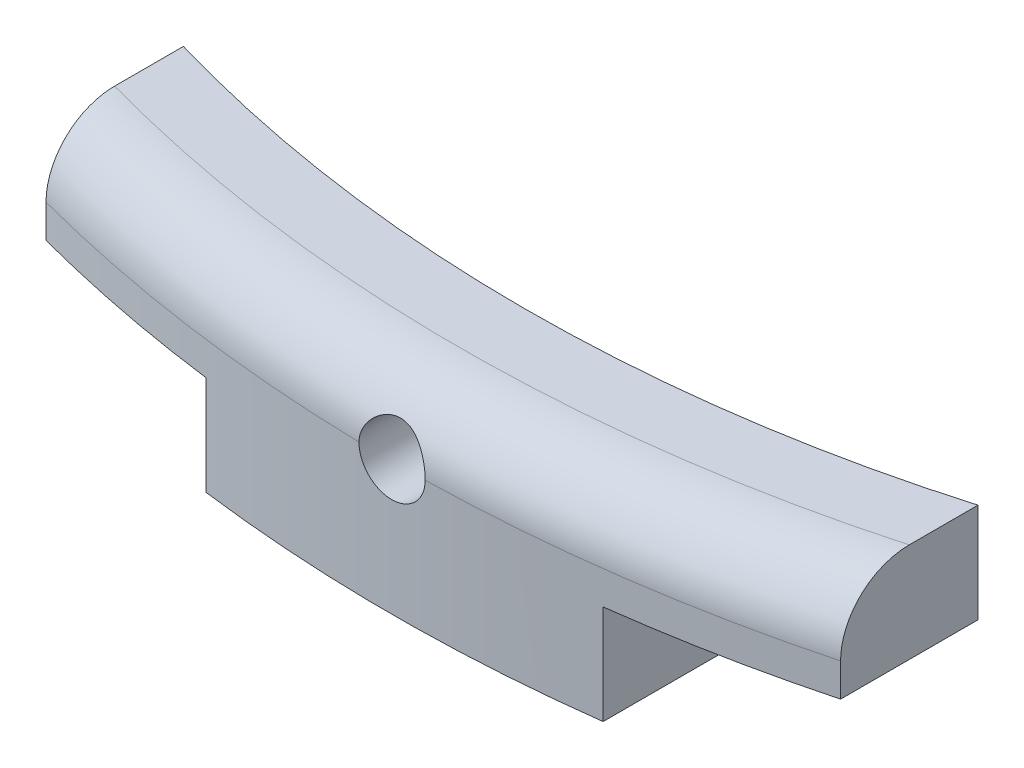
ISO-10303-21;
HEADER;
FILE_DESCRIPTION(('STEP AP214'),'2;1');
FILE_NAME('part.step','',(''),(''),'','','');
FILE_SCHEMA(('AUTOMOTIVE_DESIGN { 1 0 10303 214 1 1 1 1 }'));
ENDSEC;
DATA;
#1=APPLICATION_CONTEXT('core data for automotive mechanical design processes');
#2=APPLICATION_PROTOCOL_DEFINITION('international standard','automotive_design',2000,#1);
#3=PRODUCT_CONTEXT('',#1,'mechanical');
#4=PRODUCT('Part','Part','',(#3));
#5=PRODUCT_RELATED_PRODUCT_CATEGORY('part','',(#4));
#6=PRODUCT_DEFINITION_FORMATION('','',#4);
#7=PRODUCT_DEFINITION_CONTEXT('part definition',#1,'design');
#8=PRODUCT_DEFINITION('design','',#6,#7);
#9=PRODUCT_DEFINITION_SHAPE('','',#8);
#10=(LENGTH_UNIT() NAMED_UNIT(*) SI_UNIT(.MILLI.,.METRE.));
#11=(NAMED_UNIT(*) PLANE_ANGLE_UNIT() SI_UNIT($,.RADIAN.));
#12=(NAMED_UNIT(*) SI_UNIT($,.STERADIAN.) SOLID_ANGLE_UNIT());
#13=UNCERTAINTY_MEASURE_WITH_UNIT(LENGTH_MEASURE(1.E-05),#10,'distance_accuracy_value','');
#14=(GEOMETRIC_REPRESENTATION_CONTEXT(3) GLOBAL_UNCERTAINTY_ASSIGNED_CONTEXT((#13)) GLOBAL_UNIT_ASSIGNED_CONTEXT((#10,
#11,#12)) REPRESENTATION_CONTEXT('',''));
#15=CARTESIAN_POINT('',(0.,0.,0.));
#16=DIRECTION('',(0.,0.,1.));
#17=DIRECTION('',(1.,0.,0.));
#18=AXIS2_PLACEMENT_3D('',#15,#16,#17);
#19=CARTESIAN_POINT('',(0.,3.,0.));
#20=DIRECTION('',(0.,-1.,0.));
#21=DIRECTION('',(0.,0.,-1.));
#22=AXIS2_PLACEMENT_3D('',#19,#20,#21);
#23=CYLINDRICAL_SURFACE('',#22,21.5);
#24=CARTESIAN_POINT('',(0.,3.,0.));
#25=DIRECTION('',(0.,-1.,0.));
#26=DIRECTION('',(0.,0.,1.));
#27=AXIS2_PLACEMENT_3D('',#24,#25,#26);
#28=CIRCLE('',#27,21.5);
#29=CARTESIAN_POINT('',(6.,3.,20.6458228220626));
#30=VERTEX_POINT('',#29);
#31=CARTESIAN_POINT('',(-6.,3.,20.6458228220626));
#32=VERTEX_POINT('',#31);
#33=EDGE_CURVE('E173',#30,#32,#28,.T.);
#34=ORIENTED_EDGE('',*,*,#33,.F.);
#35=DIRECTION('',(0.,1.,0.));
#36=VECTOR('',#35,1.);
#37=CARTESIAN_POINT('',(6.,1.5,20.6458228220626));
#38=LINE('',#37,#36);
#39=CARTESIAN_POINT('',(6.,1.5,20.6458228220626));
#40=VERTEX_POINT('',#39);
#41=EDGE_CURVE('E326',#40,#30,#38,.T.);
#42=ORIENTED_EDGE('',*,*,#41,.F.);
#43=CARTESIAN_POINT('',(0.,1.5,0.));
#44=DIRECTION('',(0.,-1.,0.));
#45=DIRECTION('',(0.,0.,1.));
#46=AXIS2_PLACEMENT_3D('',#43,#44,#45);
#47=CIRCLE('',#46,21.5);
#48=CARTESIAN_POINT('',(3.,1.5,21.2896688560438));
#49=VERTEX_POINT('',#48);
#50=EDGE_CURVE('E188',#40,#49,#47,.T.);
#51=ORIENTED_EDGE('',*,*,#50,.T.);
#52=DIRECTION('',(0.,-1.,0.));
#53=VECTOR('',#52,1.);
#54=CARTESIAN_POINT('',(3.,3.,21.2896688560438));
#55=LINE('',#54,#53);
#56=CARTESIAN_POINT('',(3.,0.,21.2896688560438));
#57=VERTEX_POINT('',#56);
#58=EDGE_CURVE('E303',#49,#57,#55,.T.);
#59=ORIENTED_EDGE('',*,*,#58,.T.);
#60=CARTESIAN_POINT('',(0.,0.,0.));
#61=DIRECTION('',(0.,-1.,0.));
#62=DIRECTION('',(0.,0.,1.));
#63=AXIS2_PLACEMENT_3D('',#60,#61,#62);
#64=CIRCLE('',#63,21.5);
#65=CARTESIAN_POINT('',(-3.,0.,21.2896688560438));
#66=VERTEX_POINT('',#65);
#67=EDGE_CURVE('E323',#57,#66,#64,.T.);
#68=ORIENTED_EDGE('',*,*,#67,.T.);
#69=DIRECTION('',(0.,-1.,0.));
#70=VECTOR('',#69,1.);
#71=CARTESIAN_POINT('',(-3.,3.,21.2896688560438));
#72=LINE('',#71,#70);
#73=CARTESIAN_POINT('',(-3.,1.5,21.2896688560438));
#74=VERTEX_POINT('',#73);
#75=EDGE_CURVE('E304',#74,#66,#72,.T.);
#76=ORIENTED_EDGE('',*,*,#75,.F.);
#77=CARTESIAN_POINT('',(-6.,1.5,20.6458228220626));
#78=VERTEX_POINT('',#77);
#79=EDGE_CURVE('E338',#74,#78,#47,.T.);
#80=ORIENTED_EDGE('',*,*,#79,.T.);
#81=DIRECTION('',(0.,1.,0.));
#82=VECTOR('',#81,1.);
#83=CARTESIAN_POINT('',(-6.,1.5,20.6458228220626));
#84=LINE('',#83,#82);
#85=EDGE_CURVE('E337',#78,#32,#84,.T.);
#86=ORIENTED_EDGE('',*,*,#85,.T.);
#87=EDGE_LOOP('',(#34,#42,#51,#59,#68,#76,#80,#86));
#88=FACE_BOUND('',#87,.T.);
#89=CARTESIAN_POINT('',(-0.5,2.,21.4941852602047));
#90=CARTESIAN_POINT('',(-0.499998755966297,1.97191885513614,21.494185338737));
#91=CARTESIAN_POINT('',(-0.497626408429424,1.94381744544174,21.4942408813021));
#92=CARTESIAN_POINT('',(-0.488195720650948,1.88838883302728,21.4944571070674));
#93=CARTESIAN_POINT('',(-0.481131765847627,1.86106259888415,21.4946179162393));
#94=CARTESIAN_POINT('',(-0.462519317690186,1.80799536228125,21.4950264488051));
#95=CARTESIAN_POINT('',(-0.450972997511034,1.78225359862238,21.4952741300752));
#96=CARTESIAN_POINT('',(-0.423726640826891,1.73308100889049,21.4958284440998));
#97=CARTESIAN_POINT('',(-0.408027625826196,1.70964961644194,21.4961350623515));
#98=CARTESIAN_POINT('',(-0.372915204298479,1.66574787306663,21.4967728213401));
#99=CARTESIAN_POINT('',(-0.353500782725025,1.64527833400603,21.4971039687632));
#100=CARTESIAN_POINT('',(-0.311510232957952,1.60788811758936,21.497753402203));
#101=CARTESIAN_POINT('',(-0.288933979613323,1.59096758077545,21.49807168771));
#102=CARTESIAN_POINT('',(-0.241258506293179,1.56115511212507,21.4986595360439));
#103=CARTESIAN_POINT('',(-0.216159047728313,1.54826356173614,21.4989290942564));
#104=CARTESIAN_POINT('',(-0.164151368754836,1.52687753707167,21.4993890587513));
#105=CARTESIAN_POINT('',(-0.137243154154621,1.51838304867676,21.4995794652878));
#106=CARTESIAN_POINT('',(-0.0823869444321757,1.50603373097711,21.4998596312861));
#107=CARTESIAN_POINT('',(-0.054439138852766,1.50217806013576,21.4999494090029));
#108=CARTESIAN_POINT('',(0.00170718008010479,1.49921323745673,21.5000182577353));
#109=CARTESIAN_POINT('',(0.0299056926519211,1.50010407082577,21.499997329096));
#110=CARTESIAN_POINT('',(0.0857472649433052,1.50660624664039,21.4998471403128));
#111=CARTESIAN_POINT('',(0.113390430898381,1.5122166772709,21.4997179010943));
#112=CARTESIAN_POINT('',(0.167342437398209,1.52799737958449,21.4993656828235));
#113=CARTESIAN_POINT('',(0.1936512756169,1.53816765921621,21.4991427036079));
#114=CARTESIAN_POINT('',(0.244190727243678,1.56278040650035,21.4986281035013));
#115=CARTESIAN_POINT('',(0.268421136934731,1.57722329231617,21.4983364758922));
#116=CARTESIAN_POINT('',(0.314113672988315,1.60997095276577,21.4977174499698));
#117=CARTESIAN_POINT('',(0.335575795995432,1.62827573208044,21.497390051613));
#118=CARTESIAN_POINT('',(0.375127846092383,1.66823273764598,21.4967362952916));
#119=CARTESIAN_POINT('',(0.393216973152506,1.68988575583237,21.4964099375917));
#120=CARTESIAN_POINT('',(0.425503384037781,1.73592178799792,21.4957951346947));
#121=CARTESIAN_POINT('',(0.439700667282546,1.76030480238421,21.4955066895032));
#122=CARTESIAN_POINT('',(0.463800284579462,1.81110911526541,21.4950002397015));
#123=CARTESIAN_POINT('',(0.473702593703395,1.83753042558963,21.4947822355));
#124=CARTESIAN_POINT('',(0.488930658807138,1.89166111597341,21.494441265539));
#125=CARTESIAN_POINT('',(0.494256422361824,1.91937049390094,21.4943182996221));
#126=CARTESIAN_POINT('',(0.500179236306937,1.97528378567812,21.4941812987667));
#127=CARTESIAN_POINT('',(0.50077739434082,2.00348758213703,21.4941672383124));
#128=CARTESIAN_POINT('',(0.497230903053952,2.05959520736367,21.4942495671429));
#129=CARTESIAN_POINT('',(0.493086256948856,2.08749903633476,21.4943459563528));
#130=CARTESIAN_POINT('',(0.480172726942071,2.14221154305694,21.4946382948524));
#131=CARTESIAN_POINT('',(0.471404345511334,2.16902033946647,21.4948342333239));
#132=CARTESIAN_POINT('',(0.449492760378763,2.2207854074938,21.4953035720075));
#133=CARTESIAN_POINT('',(0.436349551608551,2.24574167696534,21.4955769723094));
#134=CARTESIAN_POINT('',(0.406058547012527,2.29309836924976,21.4961704752538));
#135=CARTESIAN_POINT('',(0.38891000494981,2.31549831463273,21.496490586595));
#136=CARTESIAN_POINT('',(0.351096216975069,2.35710170879313,21.4971413929455));
#137=CARTESIAN_POINT('',(0.330430965104612,2.37630515215456,21.4974720879727));
#138=CARTESIAN_POINT('',(0.286165633179736,2.41097410897975,21.4981068549215));
#139=CARTESIAN_POINT('',(0.262564993463237,2.42643890797262,21.4984109217471));
#140=CARTESIAN_POINT('',(0.213101700796868,2.4531866919116,21.4989580814401));
#141=CARTESIAN_POINT('',(0.18723905186496,2.46446968428556,21.4992011744157));
#142=CARTESIAN_POINT('',(0.133988589367627,2.48253232337691,21.4995989577116));
#143=CARTESIAN_POINT('',(0.106600933440216,2.48931243461816,21.4997536571505));
#144=CARTESIAN_POINT('',(0.0510756409768839,2.49817837439227,21.499957249993));
#145=CARTESIAN_POINT('',(0.0229380042960178,2.50026420201787,21.5000061433762));
#146=CARTESIAN_POINT('',(-0.0332813313138092,2.49968230436628,21.4999926126193));
#147=CARTESIAN_POINT('',(-0.0613630419438295,2.49701570827316,21.4999302149222));
#148=CARTESIAN_POINT('',(-0.116680106658745,2.48700697298764,21.499701186257));
#149=CARTESIAN_POINT('',(-0.143915459055956,2.47966482447257,21.4995345550811));
#150=CARTESIAN_POINT('',(-0.196767300396706,2.46051348702593,21.4991158337094));
#151=CARTESIAN_POINT('',(-0.222383760585855,2.44870421877643,21.4988637419961));
#152=CARTESIAN_POINT('',(-0.271269750679197,2.42095445611713,21.4983025159235));
#153=CARTESIAN_POINT('',(-0.294539368313775,2.4050141162159,21.4979933836977));
#154=CARTESIAN_POINT('',(-0.338075842972769,2.36945214804196,21.4973528527812));
#155=CARTESIAN_POINT('',(-0.358342305663433,2.34983003709403,21.4970214511746));
#156=CARTESIAN_POINT('',(-0.395298732697557,2.30745619072678,21.4963736832631));
#157=CARTESIAN_POINT('',(-0.411987808875125,2.28470368041281,21.496057320707));
#158=CARTESIAN_POINT('',(-0.441317463383388,2.23670797367039,21.4954752190066));
#159=CARTESIAN_POINT('',(-0.453955688419948,2.21146334056983,21.4952095093246));
#160=CARTESIAN_POINT('',(-0.474799808058266,2.1592295659464,21.4947592419056));
#161=CARTESIAN_POINT('',(-0.483010999327688,2.13224255257445,21.4945745872407));
#162=CARTESIAN_POINT('',(-0.492586962874531,2.08757038117134,21.4943567169088));
#163=CARTESIAN_POINT('',(-0.495363365332656,2.07017530815001,21.4942926990413));
#164=CARTESIAN_POINT('',(-0.499070273557217,2.03518947649953,21.4942069460845));
#165=CARTESIAN_POINT('',(-0.500000779647636,2.01759871790474,21.4941852109877));
#166=CARTESIAN_POINT('',(-0.5,2.,21.4941852602047));
#167=B_SPLINE_CURVE_WITH_KNOTS('',3,(#89,#90,#91,#92,#93,#94,#95,#96,#97,#98,#99,#100,#101,#102,
#103,#104,#105,#106,#107,#108,#109,#110,#111,#112,#113,#114,#115,#116,#117,#118,#119,#120,#121,
#122,#123,#124,#125,#126,#127,#128,#129,#130,#131,#132,#133,#134,#135,#136,#137,#138,#139,#140,
#141,#142,#143,#144,#145,#146,#147,#148,#149,#150,#151,#152,#153,#154,#155,#156,#157,#158,#159,
#160,#161,#162,#163,#164,#165,#166),.UNSPECIFIED.,.T.,.F.,(4,2,2,2,2,2,2,2,2,2,2,2,2,2,2,2,2,2,
2,2,2,2,2,2,2,2,2,2,2,2,2,2,2,2,2,2,2,2,4),(0.,0.0841791979092221,0.168459317089465,
0.252698625860825,0.336917232190344,0.421158879914501,0.505403863018055,0.589656819668832,
0.673909505773871,0.758146905134822,0.842384041955608,0.926604908096697,1.01082592105048,
1.09505517951109,1.17928454006421,1.26353385335776,1.34778317921534,1.43203299405316,
1.51628266944452,1.60051260516676,1.68474248378055,1.76896321084374,1.85318403547968,
1.93742056390023,2.0216572350459,2.10590999147555,2.19016259825175,2.27440651205381,
2.3586504421375,2.44287435838663,2.52709844257208,2.61132402230617,2.69554645232599,
2.77977993151713,2.86403429938594,2.94833752549202,3.03253966298692,3.0852955682269,
3.1380514642074),.UNSPECIFIED.);
#168=CARTESIAN_POINT('',(-0.5,2.,21.4941852602047));
#169=VERTEX_POINT('',#168);
#170=EDGE_CURVE('E118',#169,#169,#167,.T.);
#171=ORIENTED_EDGE('',*,*,#170,.T.);
#172=EDGE_LOOP('',(#171));
#173=FACE_BOUND('',#172,.T.);
#174=ADVANCED_FACE('F33',(#88,#173),#23,.F.);
#175=CARTESIAN_POINT('',(0.,3.,0.));
#176=DIRECTION('',(0.,-1.,0.));
#177=DIRECTION('',(0.,0.,-1.));
#178=AXIS2_PLACEMENT_3D('',#175,#176,#177);
#179=CYLINDRICAL_SURFACE('',#178,23.5);
#180=CARTESIAN_POINT('',(0.5,2.,23.4946802489415));
#181=CARTESIAN_POINT('',(0.5000239012505,1.97187495020581,23.4946783023282));
#182=CARTESIAN_POINT('',(0.497628374945154,1.94375710538118,23.4947306971344));
#183=CARTESIAN_POINT('',(0.48817468976348,1.88833718398176,23.4949297868081));
#184=CARTESIAN_POINT('',(0.481119986575986,1.86103451846738,23.4950764117834));
#185=CARTESIAN_POINT('',(0.46251941203673,1.80799012424866,23.4954497044488));
#186=CARTESIAN_POINT('',(0.450971475141283,1.7822491197412,23.495676408947));
#187=CARTESIAN_POINT('',(0.42372274852547,1.73307571555411,23.4961836311518));
#188=CARTESIAN_POINT('',(0.408022760430556,1.70964287144137,23.4964641384678));
#189=CARTESIAN_POINT('',(0.372909456137809,1.66574134811288,23.497047593182));
#190=CARTESIAN_POINT('',(0.353495534988105,1.64527315275595,23.4973505442309));
#191=CARTESIAN_POINT('',(0.311504087698404,1.60788315420172,23.4979447043537));
#192=CARTESIAN_POINT('',(0.288926080272495,1.5909618915038,23.4982359116325));
#193=CARTESIAN_POINT('',(0.241247962797727,1.5611492690502,23.4987737324286));
#194=CARTESIAN_POINT('',(0.216147724773407,1.54825811391474,23.4990203436814));
#195=CARTESIAN_POINT('',(0.164140266481915,1.52687376375069,23.4994411316055));
#196=CARTESIAN_POINT('',(0.137233163610803,1.51838028330706,23.4996153129774));
#197=CARTESIAN_POINT('',(0.0823781118914567,1.50603225895979,23.4998716085604));
#198=CARTESIAN_POINT('',(0.0544303019691278,1.50217709815071,23.4999537350148));
#199=CARTESIAN_POINT('',(-0.00171661877036668,1.49921323455984,23.500016703993));
#200=CARTESIAN_POINT('',(-0.0299157350736507,1.50010463565203,23.4999975443002));
#201=CARTESIAN_POINT('',(-0.0857590356785831,1.50660822185892,23.4998601081157));
#202=CARTESIAN_POINT('',(-0.113403314526651,1.5122195955581,23.4997418486603));
#203=CARTESIAN_POINT('',(-0.167357266505371,1.52800256757622,23.499419564031));
#204=CARTESIAN_POINT('',(-0.193666943148384,1.53817415389306,23.4992155390828));
#205=CARTESIAN_POINT('',(-0.244208092072518,1.56278999946872,23.4987446874388));
#206=CARTESIAN_POINT('',(-0.26843933880874,1.5772347216805,23.498477853939));
#207=CARTESIAN_POINT('',(-0.314131955834937,1.60998567310042,23.4979114827668));
#208=CARTESIAN_POINT('',(-0.335593458199145,1.62829171807308,23.4976119466551));
#209=CARTESIAN_POINT('',(-0.375140662693392,1.6682475442818,23.4970138844919));
#210=CARTESIAN_POINT('',(-0.393226148354517,1.68989753976817,23.4967153585064));
#211=CARTESIAN_POINT('',(-0.425511315618826,1.73593439680004,23.4961529191999));
#212=CARTESIAN_POINT('',(-0.439709762829113,1.76032212429844,23.4958890168881));
#213=CARTESIAN_POINT('',(-0.4638185462251,1.81114946862726,23.4954254634994));
#214=CARTESIAN_POINT('',(-0.473726252783628,1.83759033207278,23.4952258518428));
#215=CARTESIAN_POINT('',(-0.48894262277272,1.89172785667683,23.4949142696192));
#216=CARTESIAN_POINT('',(-0.494258307725359,1.91942253217635,23.4948021652729));
#217=CARTESIAN_POINT('',(-0.499075521759939,1.96484292492919,23.4946998278548));
#218=CARTESIAN_POINT('',(-0.500007518467565,1.98242607246765,23.4946797057675));
#219=CARTESIAN_POINT('',(-0.5,2.,23.4946802489415));
#220=B_SPLINE_CURVE_WITH_KNOTS('',3,(#180,#181,#182,#183,#184,#185,#186,#187,#188,#189,#190,
#191,#192,#193,#194,#195,#196,#197,#198,#199,#200,#201,#202,#203,#204,#205,#206,#207,#208,#209,
#210,#211,#212,#213,#214,#215,#216,#217,#218,#219),.UNSPECIFIED.,.F.,.F.,(4,2,2,2,2,2,2,2,2,2,2,
2,2,2,2,2,2,2,2,4),(0.,0.0842629323957733,0.168463437466064,0.252702695404556,0.33692570135238,
0.421162437842469,0.505412001431646,0.58966584192007,0.673914213534217,0.758151378713671,
0.842390387350772,0.92661491732905,1.01083922563652,1.09507266217735,1.17930208059277,
1.26353689791293,1.34779843443426,1.4321115387279,1.51629549303206,1.56901707022118),.UNSPECIFIED.);
#221=CARTESIAN_POINT('',(0.5,2.,23.4946802489415));
#222=VERTEX_POINT('',#221);
#223=CARTESIAN_POINT('',(-0.5,2.,23.4946802489415));
#224=VERTEX_POINT('',#223);
#225=EDGE_CURVE('E53',#222,#224,#220,.T.);
#226=ORIENTED_EDGE('',*,*,#225,.T.);
#227=CARTESIAN_POINT('',(0.,2.,0.));
#228=DIRECTION('',(0.,1.,0.));
#229=DIRECTION('',(0.,0.,1.));
#230=AXIS2_PLACEMENT_3D('',#227,#228,#229);
#231=CIRCLE('',#230,23.5);
#232=CARTESIAN_POINT('',(-6.,2.,22.7211355350035));
#233=VERTEX_POINT('',#232);
#234=EDGE_CURVE('E60',#224,#233,#231,.F.);
#235=ORIENTED_EDGE('',*,*,#234,.T.);
#236=DIRECTION('',(0.,1.,0.));
#237=VECTOR('',#236,1.);
#238=CARTESIAN_POINT('',(-6.,1.5,22.7211355350035));
#239=LINE('',#238,#237);
#240=CARTESIAN_POINT('',(-6.,1.5,22.7211355350035));
#241=VERTEX_POINT('',#240);
#242=EDGE_CURVE('E341',#241,#233,#239,.T.);
#243=ORIENTED_EDGE('',*,*,#242,.F.);
#244=CARTESIAN_POINT('',(0.,1.5,0.));
#245=DIRECTION('',(0.,1.,0.));
#246=DIRECTION('',(0.,0.,1.));
#247=AXIS2_PLACEMENT_3D('',#244,#245,#246);
#248=CIRCLE('',#247,23.5);
#249=CARTESIAN_POINT('',(-3.,1.5,23.3077240416133));
#250=VERTEX_POINT('',#249);
#251=EDGE_CURVE('E296',#241,#250,#248,.T.);
#252=ORIENTED_EDGE('',*,*,#251,.T.);
#253=DIRECTION('',(0.,-1.,0.));
#254=VECTOR('',#253,1.);
#255=CARTESIAN_POINT('',(-3.,3.,23.3077240416133));
#256=LINE('',#255,#254);
#257=CARTESIAN_POINT('',(-3.,0.,23.3077240416133));
#258=VERTEX_POINT('',#257);
#259=EDGE_CURVE('E308',#250,#258,#256,.T.);
#260=ORIENTED_EDGE('',*,*,#259,.T.);
#261=CARTESIAN_POINT('',(0.,0.,0.));
#262=DIRECTION('',(0.,1.,0.));
#263=DIRECTION('',(0.,0.,1.));
#264=AXIS2_PLACEMENT_3D('',#261,#262,#263);
#265=CIRCLE('',#264,23.5);
#266=CARTESIAN_POINT('',(3.,0.,23.3077240416133));
#267=VERTEX_POINT('',#266);
#268=EDGE_CURVE('E306',#258,#267,#265,.T.);
#269=ORIENTED_EDGE('',*,*,#268,.T.);
#270=DIRECTION('',(0.,-1.,0.));
#271=VECTOR('',#270,1.);
#272=CARTESIAN_POINT('',(3.,3.,23.3077240416133));
#273=LINE('',#272,#271);
#274=CARTESIAN_POINT('',(3.,1.5,23.3077240416133));
#275=VERTEX_POINT('',#274);
#276=EDGE_CURVE('E301',#275,#267,#273,.T.);
#277=ORIENTED_EDGE('',*,*,#276,.F.);
#278=CARTESIAN_POINT('',(6.,1.5,22.7211355350035));
#279=VERTEX_POINT('',#278);
#280=EDGE_CURVE('E287',#275,#279,#248,.T.);
#281=ORIENTED_EDGE('',*,*,#280,.T.);
#282=DIRECTION('',(0.,1.,0.));
#283=VECTOR('',#282,1.);
#284=CARTESIAN_POINT('',(6.,1.5,22.7211355350035));
#285=LINE('',#284,#283);
#286=CARTESIAN_POINT('',(6.,2.,22.7211355350035));
#287=VERTEX_POINT('',#286);
#288=EDGE_CURVE('E348',#279,#287,#285,.T.);
#289=ORIENTED_EDGE('',*,*,#288,.T.);
#290=EDGE_CURVE('E47',#287,#222,#231,.F.);
#291=ORIENTED_EDGE('',*,*,#290,.T.);
#292=EDGE_LOOP('',(#226,#235,#243,#252,#260,#269,#277,#281,#289,#291));
#293=FACE_BOUND('',#292,.T.);
#294=ADVANCED_FACE('F120',(#293),#179,.T.);
#295=CARTESIAN_POINT('',(0.,2.,0.));
#296=DIRECTION('',(0.,1.,0.));
#297=DIRECTION('',(0.,0.,1.));
#298=AXIS2_PLACEMENT_3D('',#295,#296,#297);
#299=TOROIDAL_SURFACE('',#298,22.5,1.);
#300=ORIENTED_EDGE('',*,*,#234,.F.);
#301=CARTESIAN_POINT('',(0.496157695524152,1.93813287486748,23.4928456717974));
#302=CARTESIAN_POINT('',(0.499394852554745,1.96383193950509,23.4944054519467));
#303=CARTESIAN_POINT('',(0.500577788038148,1.98983167754558,23.4949617238289));
#304=CARTESIAN_POINT('',(0.498928684620493,2.04158302485736,23.4941625194863));
#305=CARTESIAN_POINT('',(0.496111043623158,2.06733518981437,23.4928138989782));
#306=CARTESIAN_POINT('',(0.486576523182537,2.11793527634416,23.4883101849599));
#307=CARTESIAN_POINT('',(0.479859949059758,2.14278326855967,23.4851552329015));
#308=CARTESIAN_POINT('',(0.462805597638775,2.19095565287459,23.4773427795423));
#309=CARTESIAN_POINT('',(0.452465844697611,2.21427920547979,23.4726844585957));
#310=CARTESIAN_POINT('',(0.428069507341816,2.2597021795056,23.4620805098579));
#311=CARTESIAN_POINT('',(0.413892372632721,2.28172716347473,23.456094529873));
#312=CARTESIAN_POINT('',(0.382391943674219,2.32319538401133,23.4434694494658));
#313=CARTESIAN_POINT('',(0.365066764390285,2.34263706156544,23.436829958822));
#314=CARTESIAN_POINT('',(0.325905423914674,2.38024819298707,23.4228655053961));
#315=CARTESIAN_POINT('',(0.30380115124988,2.39813699236273,23.415533571572));
#316=CARTESIAN_POINT('',(0.256714546772383,2.43000680699897,23.4015995308564));
#317=CARTESIAN_POINT('',(0.231731672019741,2.44398708335443,23.3949975621068));
#318=CARTESIAN_POINT('',(0.179254963576715,2.46765429784803,23.3833402990105));
#319=CARTESIAN_POINT('',(0.151746380830867,2.47731379258108,23.3782949525817));
#320=CARTESIAN_POINT('',(0.0951626415804063,2.49172487610294,23.3706141175674));
#321=CARTESIAN_POINT('',(0.0660896568611888,2.49648309311991,23.3679753749737));
#322=CARTESIAN_POINT('',(0.010781174796544,2.50056344503285,23.3657142336356));
#323=CARTESIAN_POINT('',(-0.015401733024204,2.50044141632145,23.3657833964375));
#324=CARTESIAN_POINT('',(-0.067325109407192,2.49613084374181,23.3681686804572));
#325=CARTESIAN_POINT('',(-0.0930655613029042,2.49194214702956,23.3704848861291));
#326=CARTESIAN_POINT('',(-0.142130728430177,2.48000649267266,23.3768697146086));
#327=CARTESIAN_POINT('',(-0.165512086690029,2.47244041350812,23.3808486698436));
#328=CARTESIAN_POINT('',(-0.210704032363039,2.45409152444799,23.3900768439237));
#329=CARTESIAN_POINT('',(-0.232514125940232,2.44330770867159,23.3953264598867));
#330=CARTESIAN_POINT('',(-0.276258243587337,2.41759668121388,23.4071355486935));
#331=CARTESIAN_POINT('',(-0.297992573508181,2.40236583000776,23.4137731287659));
#332=CARTESIAN_POINT('',(-0.338754759320203,2.36870669242894,23.4272845379332));
#333=CARTESIAN_POINT('',(-0.357780932638865,2.35027643391548,23.4341585106344));
#334=CARTESIAN_POINT('',(-0.394354776409781,2.30873619518564,23.4481163093594));
#335=CARTESIAN_POINT('',(-0.411608235327695,2.285352419032,23.4551618631046));
#336=CARTESIAN_POINT('',(-0.44192148568655,2.23569174008084,23.4680117312782));
#337=CARTESIAN_POINT('',(-0.454982125747798,2.20941542417672,23.4738162968013));
#338=CARTESIAN_POINT('',(-0.475992518153564,2.1556699761238,23.4833519540219));
#339=CARTESIAN_POINT('',(-0.484111313752636,2.12827931050837,23.487150953069));
#340=CARTESIAN_POINT('',(-0.495561880460729,2.07232089625481,23.4925500010774));
#341=CARTESIAN_POINT('',(-0.498901557263543,2.04375517215256,23.4941536813784));
#342=CARTESIAN_POINT('',(-0.50016190498746,2.0022614942577,23.4947580702711));
#343=CARTESIAN_POINT('',(-0.500053089512868,1.9893767273031,23.4947054502669));
#344=CARTESIAN_POINT('',(-0.498844609807759,1.96368301798529,23.494127446266));
#345=CARTESIAN_POINT('',(-0.497746380730206,1.95087399283678,23.4936027470257));
#346=CARTESIAN_POINT('',(-0.496157695524175,1.93813287486748,23.4928456717974));
#347=B_SPLINE_CURVE_WITH_KNOTS('',3,(#301,#302,#303,#304,#305,#306,#307,#308,#309,#310,#311,
#312,#313,#314,#315,#316,#317,#318,#319,#320,#321,#322,#323,#324,#325,#326,#327,#328,#329,#330,
#331,#332,#333,#334,#335,#336,#337,#338,#339,#340,#341,#342,#343,#344,#345,#346),.UNSPECIFIED.,
.F.,.F.,(4,2,2,2,2,2,2,2,2,2,2,2,2,2,2,2,2,2,2,2,2,2,4),(0.,0.0777231069970227,
0.155167199844965,0.23260522896219,0.310085549279008,0.390358933150841,0.470680543713594,
0.558376087458319,0.646088198826165,0.734349765960684,0.822491815498965,0.90062695774783,
0.978765036787168,1.05314398148776,1.12754620182698,1.20928228696387,1.29106893496081,
1.38033306842821,1.46957912356019,1.55556993236615,1.64141832872824,1.68003472597744,
1.71859519983376),.UNSPECIFIED.);
#348=EDGE_CURVE('E112',#222,#224,#347,.T.);
#349=ORIENTED_EDGE('',*,*,#348,.F.);
#350=ORIENTED_EDGE('',*,*,#290,.F.);
#351=CARTESIAN_POINT('',(6.,3.,21.6852484422014));
#352=CARTESIAN_POINT('',(6.,3.00004103926792,21.7451278332612));
#353=CARTESIAN_POINT('',(6.,2.99500613015101,21.8050083231152));
#354=CARTESIAN_POINT('',(6.,2.97505082125159,21.9231219991415));
#355=CARTESIAN_POINT('',(6.,2.96012665573339,21.9813545489825));
#356=CARTESIAN_POINT('',(6.,2.92064151817873,22.0945265467526));
#357=CARTESIAN_POINT('',(6.,2.89607171904403,22.1494629249861));
#358=CARTESIAN_POINT('',(6.,2.83789584423332,22.2542970564194));
#359=CARTESIAN_POINT('',(6.,2.80429447329128,22.3041974144242));
#360=CARTESIAN_POINT('',(6.,2.72962567142654,22.396498345494));
#361=CARTESIAN_POINT('',(6.,2.68871249624509,22.4390235737506));
#362=CARTESIAN_POINT('',(6.,2.60009081964245,22.5163173853718));
#363=CARTESIAN_POINT('',(6.,2.55238155220285,22.551085093216));
#364=CARTESIAN_POINT('',(6.,2.45327453232358,22.6106057460769));
#365=CARTESIAN_POINT('',(6.,2.4020558774593,22.6356573833609));
#366=CARTESIAN_POINT('',(6.,2.29607285391206,22.6764865937553));
#367=CARTESIAN_POINT('',(6.,2.24131242010137,22.6922742690002));
#368=CARTESIAN_POINT('',(6.,2.15505772594113,22.7091352347786));
#369=CARTESIAN_POINT('',(6.,2.1241954319129,22.713633237984));
#370=CARTESIAN_POINT('',(6.,2.06222726450243,22.7196319843357));
#371=CARTESIAN_POINT('',(6.,2.03112182078135,22.7211371674927));
#372=CARTESIAN_POINT('',(6.,2.,22.7211355350035));
#373=B_SPLINE_CURVE_WITH_KNOTS('',3,(#351,#352,#353,#354,#355,#356,#357,#358,#359,#360,#361,
#362,#363,#364,#365,#366,#367,#368,#369,#370,#371,#372),.UNSPECIFIED.,.F.,.F.,(4,2,2,2,2,2,2,2,
2,2,4),(0.,0.179431005974517,0.358930376880404,0.538594399073307,0.718165011310352,
0.894318226639745,1.07049131273124,1.24071174118464,1.41074620160674,1.50418187409776,
1.5974788259686),.UNSPECIFIED.);
#374=CARTESIAN_POINT('',(6.,3.,21.6852484422014));
#375=VERTEX_POINT('',#374);
#376=EDGE_CURVE('E126',#375,#287,#373,.T.);
#377=ORIENTED_EDGE('',*,*,#376,.F.);
#378=CARTESIAN_POINT('',(0.,3.,0.));
#379=DIRECTION('',(0.,1.,0.));
#380=DIRECTION('',(0.,0.,1.));
#381=AXIS2_PLACEMENT_3D('',#378,#379,#380);
#382=CIRCLE('',#381,22.5);
#383=CARTESIAN_POINT('',(-6.,3.,21.6852484422014));
#384=VERTEX_POINT('',#383);
#385=EDGE_CURVE('E127',#384,#375,#382,.T.);
#386=ORIENTED_EDGE('',*,*,#385,.F.);
#387=CARTESIAN_POINT('',(-6.,2.,22.7211355350035));
#388=CARTESIAN_POINT('',(-6.,2.02745073174559,22.721135818488));
#389=CARTESIAN_POINT('',(-6.,2.05488807771176,22.719965701273));
#390=CARTESIAN_POINT('',(-6.,2.10956135299952,22.7153008113828));
#391=CARTESIAN_POINT('',(-6.,2.13679730455405,22.711806299303));
#392=CARTESIAN_POINT('',(-6.,2.21781318444896,22.6978835711677));
#393=CARTESIAN_POINT('',(-6.,2.27104211431011,22.6840159725104));
#394=CARTESIAN_POINT('',(-6.,2.37440093685719,22.647565912153));
#395=CARTESIAN_POINT('',(-6.,2.42453030717642,22.6249819861154));
#396=CARTESIAN_POINT('',(-6.,2.52036461025258,22.5718294520246));
#397=CARTESIAN_POINT('',(-6.,2.56606920052671,22.5412602265767));
#398=CARTESIAN_POINT('',(-6.,2.65247003608484,22.4726103397903));
#399=CARTESIAN_POINT('',(-6.,2.69308822810153,22.4344315933664));
#400=CARTESIAN_POINT('',(-6.,2.76758172676673,22.3519781171758));
#401=CARTESIAN_POINT('',(-6.,2.80145548299908,22.3077019896864));
#402=CARTESIAN_POINT('',(-6.,2.86263853066453,22.2128307732336));
#403=CARTESIAN_POINT('',(-6.,2.88970637832212,22.1620801439931));
#404=CARTESIAN_POINT('',(-6.,2.93523862253908,22.0568572357534));
#405=CARTESIAN_POINT('',(-6.,2.9537036750339,22.0023852408596));
#406=CARTESIAN_POINT('',(-6.,2.97842318161966,21.9040621959852));
#407=CARTESIAN_POINT('',(-6.,2.98651226577696,21.8606616078032));
#408=CARTESIAN_POINT('',(-6.,2.99730077342504,21.7732602656323));
#409=CARTESIAN_POINT('',(-6.,3.00000810961716,21.7292604886726));
#410=CARTESIAN_POINT('',(-6.,3.,21.6852484422014));
#411=B_SPLINE_CURVE_WITH_KNOTS('',3,(#387,#388,#389,#390,#391,#392,#393,#394,#395,#396,#397,
#398,#399,#400,#401,#402,#403,#404,#405,#406,#407,#408,#409,#410),.UNSPECIFIED.,.F.,.F.,(4,2,2,
2,2,2,2,2,2,2,2,4),(0.,0.0823008059698548,0.164592386482159,0.328758085755092,0.492951376774785,
0.65715736639086,0.823635528716044,0.990151917097486,1.1619336988503,1.33370238065056,
1.4658253510834,1.59775391903658),.UNSPECIFIED.);
#412=EDGE_CURVE('E11',#233,#384,#411,.T.);
#413=ORIENTED_EDGE('',*,*,#412,.F.);
#414=EDGE_LOOP('',(#300,#349,#350,#377,#386,#413));
#415=FACE_BOUND('',#414,.T.);
#416=ADVANCED_FACE('F35',(#415),#299,.T.);
#417=CARTESIAN_POINT('',(-3.,3.,23.3077240416133));
#418=DIRECTION('',(1.,0.,0.));
#419=DIRECTION('',(0.,0.,-1.));
#420=AXIS2_PLACEMENT_3D('',#417,#418,#419);
#421=PLANE('',#420);
#422=DIRECTION('',(0.,0.,1.));
#423=VECTOR('',#422,1.);
#424=CARTESIAN_POINT('',(-3.,1.5,23.3077240416133));
#425=LINE('',#424,#423);
#426=EDGE_CURVE('E320',#74,#250,#425,.T.);
#427=ORIENTED_EDGE('',*,*,#426,.F.);
#428=ORIENTED_EDGE('',*,*,#75,.T.);
#429=DIRECTION('',(0.,0.,1.));
#430=VECTOR('',#429,1.);
#431=CARTESIAN_POINT('',(-3.,0.,23.3077240416133));
#432=LINE('',#431,#430);
#433=EDGE_CURVE('E319',#66,#258,#432,.T.);
#434=ORIENTED_EDGE('',*,*,#433,.T.);
#435=ORIENTED_EDGE('',*,*,#259,.F.);
#436=EDGE_LOOP('',(#427,#428,#434,#435));
#437=FACE_BOUND('',#436,.T.);
#438=ADVANCED_FACE('F160',(#437),#421,.F.);
#439=CARTESIAN_POINT('',(3.,3.,23.3077240416133));
#440=DIRECTION('',(-1.,0.,0.));
#441=DIRECTION('',(0.,0.,1.));
#442=AXIS2_PLACEMENT_3D('',#439,#440,#441);
#443=PLANE('',#442);
#444=DIRECTION('',(0.,0.,-1.));
#445=VECTOR('',#444,1.);
#446=CARTESIAN_POINT('',(3.,1.5,23.3077240416133));
#447=LINE('',#446,#445);
#448=EDGE_CURVE('E290',#275,#49,#447,.T.);
#449=ORIENTED_EDGE('',*,*,#448,.F.);
#450=ORIENTED_EDGE('',*,*,#276,.T.);
#451=DIRECTION('',(0.,0.,-1.));
#452=VECTOR('',#451,1.);
#453=CARTESIAN_POINT('',(3.,0.,23.3077240416133));
#454=LINE('',#453,#452);
#455=EDGE_CURVE('E330',#267,#57,#454,.T.);
#456=ORIENTED_EDGE('',*,*,#455,.T.);
#457=ORIENTED_EDGE('',*,*,#58,.F.);
#458=EDGE_LOOP('',(#449,#450,#456,#457));
#459=FACE_BOUND('',#458,.T.);
#460=ADVANCED_FACE('F153',(#459),#443,.F.);
#461=CARTESIAN_POINT('',(0.,3.,0.));
#462=DIRECTION('',(0.,1.,0.));
#463=DIRECTION('',(0.,0.,1.));
#464=AXIS2_PLACEMENT_3D('',#461,#462,#463);
#465=PLANE('',#464);
#466=DIRECTION('',(0.,0.,1.));
#467=VECTOR('',#466,1.);
#468=CARTESIAN_POINT('',(-6.,3.,22.7211355350035));
#469=LINE('',#468,#467);
#470=EDGE_CURVE('E122',#32,#384,#469,.T.);
#471=ORIENTED_EDGE('',*,*,#470,.T.);
#472=ORIENTED_EDGE('',*,*,#385,.T.);
#473=DIRECTION('',(0.,0.,-1.));
#474=VECTOR('',#473,1.);
#475=CARTESIAN_POINT('',(6.,3.,22.7211355350035));
#476=LINE('',#475,#474);
#477=EDGE_CURVE('E335',#375,#30,#476,.T.);
#478=ORIENTED_EDGE('',*,*,#477,.T.);
#479=ORIENTED_EDGE('',*,*,#33,.T.);
#480=EDGE_LOOP('',(#471,#472,#478,#479));
#481=FACE_BOUND('',#480,.T.);
#482=ADVANCED_FACE('F150',(#481),#465,.T.);
#483=CARTESIAN_POINT('',(0.,0.,0.));
#484=DIRECTION('',(0.,1.,0.));
#485=DIRECTION('',(0.,0.,1.));
#486=AXIS2_PLACEMENT_3D('',#483,#484,#485);
#487=PLANE('',#486);
#488=ORIENTED_EDGE('',*,*,#67,.F.);
#489=ORIENTED_EDGE('',*,*,#455,.F.);
#490=ORIENTED_EDGE('',*,*,#268,.F.);
#491=ORIENTED_EDGE('',*,*,#433,.F.);
#492=EDGE_LOOP('',(#488,#489,#490,#491));
#493=FACE_BOUND('',#492,.T.);
#494=ADVANCED_FACE('F141',(#493),#487,.F.);
#495=CARTESIAN_POINT('',(6.,1.5,22.7211355350035));
#496=DIRECTION('',(1.,0.,0.));
#497=DIRECTION('',(0.,0.,-1.));
#498=AXIS2_PLACEMENT_3D('',#495,#496,#497);
#499=PLANE('',#498);
#500=ORIENTED_EDGE('',*,*,#477,.F.);
#501=ORIENTED_EDGE('',*,*,#376,.T.);
#502=ORIENTED_EDGE('',*,*,#288,.F.);
#503=DIRECTION('',(0.,0.,-1.));
#504=VECTOR('',#503,1.);
#505=CARTESIAN_POINT('',(6.,1.5,22.7211355350035));
#506=LINE('',#505,#504);
#507=EDGE_CURVE('E293',#279,#40,#506,.T.);
#508=ORIENTED_EDGE('',*,*,#507,.T.);
#509=ORIENTED_EDGE('',*,*,#41,.T.);
#510=EDGE_LOOP('',(#500,#501,#502,#508,#509));
#511=FACE_BOUND('',#510,.T.);
#512=ADVANCED_FACE('F136',(#511),#499,.T.);
#513=CARTESIAN_POINT('',(0.,1.5,0.));
#514=DIRECTION('',(0.,1.,0.));
#515=DIRECTION('',(0.,0.,1.));
#516=AXIS2_PLACEMENT_3D('',#513,#514,#515);
#517=PLANE('',#516);
#518=ORIENTED_EDGE('',*,*,#280,.F.);
#519=ORIENTED_EDGE('',*,*,#448,.T.);
#520=ORIENTED_EDGE('',*,*,#50,.F.);
#521=ORIENTED_EDGE('',*,*,#507,.F.);
#522=EDGE_LOOP('',(#518,#519,#520,#521));
#523=FACE_BOUND('',#522,.T.);
#524=ADVANCED_FACE('F140',(#523),#517,.F.);
#525=ORIENTED_EDGE('',*,*,#79,.F.);
#526=ORIENTED_EDGE('',*,*,#426,.T.);
#527=ORIENTED_EDGE('',*,*,#251,.F.);
#528=DIRECTION('',(0.,0.,1.));
#529=VECTOR('',#528,1.);
#530=CARTESIAN_POINT('',(-6.,1.5,22.7211355350035));
#531=LINE('',#530,#529);
#532=EDGE_CURVE('E297',#78,#241,#531,.T.);
#533=ORIENTED_EDGE('',*,*,#532,.F.);
#534=EDGE_LOOP('',(#525,#526,#527,#533));
#535=FACE_BOUND('',#534,.T.);
#536=ADVANCED_FACE('F143',(#535),#517,.F.);
#537=CARTESIAN_POINT('',(-6.,1.5,22.7211355350035));
#538=DIRECTION('',(-1.,0.,0.));
#539=DIRECTION('',(0.,0.,1.));
#540=AXIS2_PLACEMENT_3D('',#537,#538,#539);
#541=PLANE('',#540);
#542=ORIENTED_EDGE('',*,*,#242,.T.);
#543=ORIENTED_EDGE('',*,*,#412,.T.);
#544=ORIENTED_EDGE('',*,*,#470,.F.);
#545=ORIENTED_EDGE('',*,*,#85,.F.);
#546=ORIENTED_EDGE('',*,*,#532,.T.);
#547=EDGE_LOOP('',(#542,#543,#544,#545,#546));
#548=FACE_BOUND('',#547,.T.);
#549=ADVANCED_FACE('F145',(#548),#541,.T.);
#550=CARTESIAN_POINT('',(0.,2.,23.501));
#551=DIRECTION('',(0.,0.,-1.));
#552=DIRECTION('',(-1.,0.,0.));
#553=AXIS2_PLACEMENT_3D('',#550,#551,#552);
#554=CYLINDRICAL_SURFACE('',#553,0.5);
#555=ORIENTED_EDGE('',*,*,#348,.T.);
#556=ORIENTED_EDGE('',*,*,#225,.F.);
#557=EDGE_LOOP('',(#555,#556));
#558=FACE_BOUND('',#557,.T.);
#559=ORIENTED_EDGE('',*,*,#170,.F.);
#560=EDGE_LOOP('',(#559));
#561=FACE_BOUND('',#560,.T.);
#562=ADVANCED_FACE('F113',(#558,#561),#554,.F.);
#563=CLOSED_SHELL('',(#174,#294,#416,#438,#460,#482,#494,#512,#524,#536,#549,#562));
#564=MANIFOLD_SOLID_BREP('B2',#563);
#565=ADVANCED_BREP_SHAPE_REPRESENTATION('',(#18,#564),#14);
#566=SHAPE_DEFINITION_REPRESENTATION(#9,#565);
ENDSEC;
END-ISO-10303-21;
